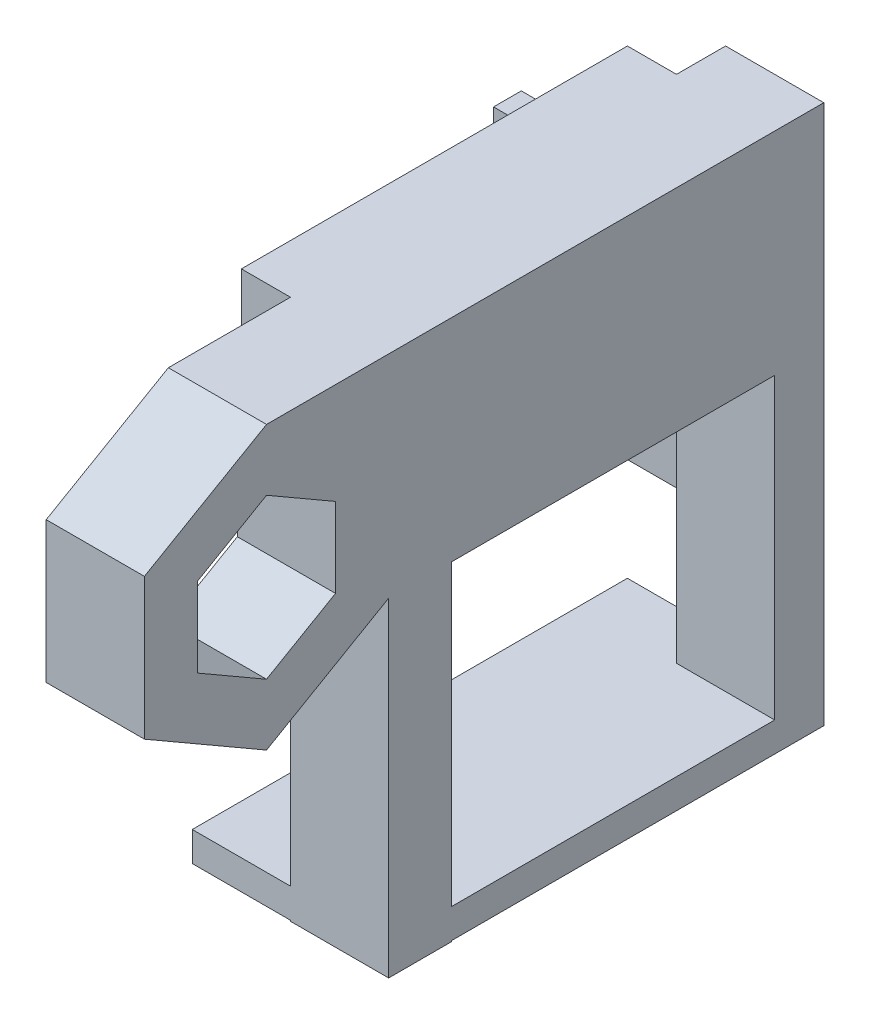
ISO-10303-21;
HEADER;
FILE_DESCRIPTION(('STEP AP214'),'2;1');
FILE_NAME('part.step','',(''),(''),'','','');
FILE_SCHEMA(('AUTOMOTIVE_DESIGN { 1 0 10303 214 1 1 1 1 }'));
ENDSEC;
DATA;
#1=APPLICATION_CONTEXT('core data for automotive mechanical design processes');
#2=APPLICATION_PROTOCOL_DEFINITION('international standard','automotive_design',2000,#1);
#3=PRODUCT_CONTEXT('',#1,'mechanical');
#4=PRODUCT('Part','Part','',(#3));
#5=PRODUCT_RELATED_PRODUCT_CATEGORY('part','',(#4));
#6=PRODUCT_DEFINITION_FORMATION('','',#4);
#7=PRODUCT_DEFINITION_CONTEXT('part definition',#1,'design');
#8=PRODUCT_DEFINITION('design','',#6,#7);
#9=PRODUCT_DEFINITION_SHAPE('','',#8);
#10=(LENGTH_UNIT() NAMED_UNIT(*) SI_UNIT(.MILLI.,.METRE.));
#11=(NAMED_UNIT(*) PLANE_ANGLE_UNIT() SI_UNIT($,.RADIAN.));
#12=(NAMED_UNIT(*) SI_UNIT($,.STERADIAN.) SOLID_ANGLE_UNIT());
#13=UNCERTAINTY_MEASURE_WITH_UNIT(LENGTH_MEASURE(1.E-05),#10,'distance_accuracy_value','');
#14=(GEOMETRIC_REPRESENTATION_CONTEXT(3) GLOBAL_UNCERTAINTY_ASSIGNED_CONTEXT((#13)) GLOBAL_UNIT_ASSIGNED_CONTEXT((#10,
#11,#12)) REPRESENTATION_CONTEXT('',''));
#15=CARTESIAN_POINT('',(0.,0.,0.));
#16=DIRECTION('',(0.,0.,1.));
#17=DIRECTION('',(1.,0.,0.));
#18=AXIS2_PLACEMENT_3D('',#15,#16,#17);
#19=CARTESIAN_POINT('',(0.,0.,0.));
#20=DIRECTION('',(1.,0.,0.));
#21=DIRECTION('',(0.,0.,-1.));
#22=AXIS2_PLACEMENT_3D('',#19,#20,#21);
#23=PLANE('',#22);
#24=DIRECTION('',(0.,-0.5,0.866025403784439));
#25=VECTOR('',#24,1.);
#26=CARTESIAN_POINT('',(0.,6.18116971697106,3.5687));
#27=LINE('',#26,#25);
#28=CARTESIAN_POINT('',(0.,8.24155962262808,0.));
#29=VERTEX_POINT('',#28);
#30=CARTESIAN_POINT('',(0.,4.12077981131404,7.13740000000001));
#31=VERTEX_POINT('',#30);
#32=EDGE_CURVE('E444',#29,#31,#27,.T.);
#33=ORIENTED_EDGE('',*,*,#32,.T.);
#34=DIRECTION('',(0.,-1.,0.));
#35=VECTOR('',#34,1.);
#36=CARTESIAN_POINT('',(0.,0.,7.13740000000001));
#37=LINE('',#36,#35);
#38=CARTESIAN_POINT('',(0.,-4.12077981131404,7.13740000000001));
#39=VERTEX_POINT('',#38);
#40=EDGE_CURVE('E459',#31,#39,#37,.T.);
#41=ORIENTED_EDGE('',*,*,#40,.T.);
#42=DIRECTION('',(0.,-0.5,-0.866025403784439));
#43=VECTOR('',#42,1.);
#44=CARTESIAN_POINT('',(0.,-6.18116971697106,3.56870000000001));
#45=LINE('',#44,#43);
#46=CARTESIAN_POINT('',(0.,-8.24155962262808,0.));
#47=VERTEX_POINT('',#46);
#48=EDGE_CURVE('E456',#39,#47,#45,.T.);
#49=ORIENTED_EDGE('',*,*,#48,.T.);
#50=DIRECTION('',(0.,0.5,-0.866025403784439));
#51=VECTOR('',#50,1.);
#52=CARTESIAN_POINT('',(0.,-6.18116971697105,-3.5687));
#53=LINE('',#52,#51);
#54=CARTESIAN_POINT('',(0.,-4.12077981131404,-7.1374));
#55=VERTEX_POINT('',#54);
#56=EDGE_CURVE('E453',#47,#55,#53,.T.);
#57=ORIENTED_EDGE('',*,*,#56,.T.);
#58=DIRECTION('',(0.,1.,0.));
#59=VECTOR('',#58,1.);
#60=CARTESIAN_POINT('',(0.,0.,-7.1374));
#61=LINE('',#60,#59);
#62=CARTESIAN_POINT('',(0.,4.12077981131404,-7.1374));
#63=VERTEX_POINT('',#62);
#64=EDGE_CURVE('E450',#55,#63,#61,.T.);
#65=ORIENTED_EDGE('',*,*,#64,.T.);
#66=DIRECTION('',(0.,0.5,0.866025403784439));
#67=VECTOR('',#66,1.);
#68=CARTESIAN_POINT('',(0.,6.18116971697106,-3.56870000000001));
#69=LINE('',#68,#67);
#70=EDGE_CURVE('E447',#63,#29,#69,.T.);
#71=ORIENTED_EDGE('',*,*,#70,.T.);
#72=EDGE_LOOP('',(#33,#41,#49,#57,#65,#71));
#73=FACE_BOUND('',#72,.T.);
#74=DIRECTION('',(0.,0.,1.));
#75=VECTOR('',#74,1.);
#76=CARTESIAN_POINT('',(0.,-24.6806074169967,-57.658));
#77=LINE('',#76,#75);
#78=CARTESIAN_POINT('',(0.,-24.6806074169967,-57.658));
#79=VERTEX_POINT('',#78);
#80=CARTESIAN_POINT('',(0.,-24.6806074169967,-54.7879844032337));
#81=VERTEX_POINT('',#80);
#82=EDGE_CURVE('E504',#79,#81,#77,.T.);
#83=ORIENTED_EDGE('',*,*,#82,.F.);
#84=DIRECTION('',(0.,1.,0.));
#85=VECTOR('',#84,1.);
#86=CARTESIAN_POINT('',(0.,14.5915596226281,-57.658));
#87=LINE('',#86,#85);
#88=CARTESIAN_POINT('',(0.,-38.182253963214,-57.658));
#89=VERTEX_POINT('',#88);
#90=EDGE_CURVE('E263',#89,#79,#87,.T.);
#91=ORIENTED_EDGE('',*,*,#90,.F.);
#92=DIRECTION('',(0.,0.,-1.));
#93=VECTOR('',#92,1.);
#94=CARTESIAN_POINT('',(0.,-38.182253963214,-57.658));
#95=LINE('',#94,#93);
#96=CARTESIAN_POINT('',(0.,-38.182253963214,-52.578));
#97=VERTEX_POINT('',#96);
#98=EDGE_CURVE('E289',#97,#89,#95,.T.);
#99=ORIENTED_EDGE('',*,*,#98,.F.);
#100=DIRECTION('',(0.,1.,0.));
#101=VECTOR('',#100,1.);
#102=CARTESIAN_POINT('',(0.,14.5915596226281,-52.578));
#103=LINE('',#102,#101);
#104=CARTESIAN_POINT('',(0.,-7.29577981131392,-52.578));
#105=VERTEX_POINT('',#104);
#106=EDGE_CURVE('E39',#97,#105,#103,.T.);
#107=ORIENTED_EDGE('',*,*,#106,.T.);
#108=DIRECTION('',(0.,0.,-1.));
#109=VECTOR('',#108,1.);
#110=CARTESIAN_POINT('',(0.,-7.29577981131392,-12.6366613140313));
#111=LINE('',#110,#109);
#112=CARTESIAN_POINT('',(0.,-7.29577981131392,-19.1149009460503));
#113=VERTEX_POINT('',#112);
#114=EDGE_CURVE('E392',#113,#105,#111,.T.);
#115=ORIENTED_EDGE('',*,*,#114,.F.);
#116=DIRECTION('',(0.,1.,0.));
#117=VECTOR('',#116,1.);
#118=CARTESIAN_POINT('',(0.,-41.3317798113139,-19.1149009460503));
#119=LINE('',#118,#117);
#120=CARTESIAN_POINT('',(0.,-38.182253963214,-19.1149009460503));
#121=VERTEX_POINT('',#120);
#122=EDGE_CURVE('E321',#121,#113,#119,.T.);
#123=ORIENTED_EDGE('',*,*,#122,.F.);
#124=CARTESIAN_POINT('',(0.,-38.182253963214,-12.6366613140313));
#125=VERTEX_POINT('',#124);
#126=EDGE_CURVE('E282',#125,#121,#95,.T.);
#127=ORIENTED_EDGE('',*,*,#126,.F.);
#128=DIRECTION('',(0.,1.,0.));
#129=VECTOR('',#128,1.);
#130=CARTESIAN_POINT('',(0.,-41.3317798113139,-12.6366613140313));
#131=LINE('',#130,#129);
#132=CARTESIAN_POINT('',(0.,-7.29577981131392,-12.6366613140313));
#133=VERTEX_POINT('',#132);
#134=EDGE_CURVE('E308',#125,#133,#131,.T.);
#135=ORIENTED_EDGE('',*,*,#134,.T.);
#136=DIRECTION('',(0.,0.500000000000007,-0.866025403784435));
#137=VECTOR('',#136,1.);
#138=CARTESIAN_POINT('',(0.,-10.943669716971,-6.31833065701568));
#139=LINE('',#138,#137);
#140=CARTESIAN_POINT('',(0.,-14.5915596226281,-1.01481323344643E-13));
#141=VERTEX_POINT('',#140);
#142=EDGE_CURVE('E441',#141,#133,#139,.T.);
#143=ORIENTED_EDGE('',*,*,#142,.F.);
#144=DIRECTION('',(0.,-0.499999999999995,-0.866025403784442));
#145=VECTOR('',#144,1.);
#146=CARTESIAN_POINT('',(0.,-10.9436697169711,6.31833065701553));
#147=LINE('',#146,#145);
#148=CARTESIAN_POINT('',(0.,-7.2957798113141,12.6366613140312));
#149=VERTEX_POINT('',#148);
#150=EDGE_CURVE('E434',#149,#141,#147,.T.);
#151=ORIENTED_EDGE('',*,*,#150,.F.);
#152=DIRECTION('',(0.,-1.,0.));
#153=VECTOR('',#152,1.);
#154=CARTESIAN_POINT('',(0.,0.,12.6366613140312));
#155=LINE('',#154,#153);
#156=CARTESIAN_POINT('',(0.,7.29577981131401,12.6366613140312));
#157=VERTEX_POINT('',#156);
#158=EDGE_CURVE('E429',#157,#149,#155,.T.);
#159=ORIENTED_EDGE('',*,*,#158,.F.);
#160=DIRECTION('',(0.,-0.500000000000001,0.866025403784438));
#161=VECTOR('',#160,1.);
#162=CARTESIAN_POINT('',(0.,10.943669716971,6.3183306570156));
#163=LINE('',#162,#161);
#164=CARTESIAN_POINT('',(0.,14.5915596226281,0.));
#165=VERTEX_POINT('',#164);
#166=EDGE_CURVE('E387',#165,#157,#163,.T.);
#167=ORIENTED_EDGE('',*,*,#166,.F.);
#168=DIRECTION('',(0.,0.,1.));
#169=VECTOR('',#168,1.);
#170=CARTESIAN_POINT('',(0.,14.5915596226281,0.));
#171=LINE('',#170,#169);
#172=CARTESIAN_POINT('',(0.,14.5915596226281,-12.6366613140313));
#173=VERTEX_POINT('',#172);
#174=EDGE_CURVE('E394',#173,#165,#171,.T.);
#175=ORIENTED_EDGE('',*,*,#174,.F.);
#176=DIRECTION('',(0.,1.,0.));
#177=VECTOR('',#176,1.);
#178=CARTESIAN_POINT('',(0.,14.5915596226281,-12.6366613140313));
#179=LINE('',#178,#177);
#180=CARTESIAN_POINT('',(0.,4.12077981131404,-12.6366613140313));
#181=VERTEX_POINT('',#180);
#182=EDGE_CURVE('E347',#181,#173,#179,.T.);
#183=ORIENTED_EDGE('',*,*,#182,.F.);
#184=DIRECTION('',(0.,0.,1.));
#185=VECTOR('',#184,1.);
#186=CARTESIAN_POINT('',(0.,4.12077981131404,-52.578));
#187=LINE('',#186,#185);
#188=CARTESIAN_POINT('',(0.,4.12077981131404,-52.578));
#189=VERTEX_POINT('',#188);
#190=EDGE_CURVE('E363',#189,#181,#187,.T.);
#191=ORIENTED_EDGE('',*,*,#190,.F.);
#192=CARTESIAN_POINT('',(0.,14.5915596226281,-52.578));
#193=VERTEX_POINT('',#192);
#194=EDGE_CURVE('E11',#189,#193,#103,.T.);
#195=ORIENTED_EDGE('',*,*,#194,.T.);
#196=DIRECTION('',(0.,0.,1.));
#197=VECTOR('',#196,1.);
#198=CARTESIAN_POINT('',(0.,14.5915596226281,-57.658));
#199=LINE('',#198,#197);
#200=CARTESIAN_POINT('',(0.,14.5915596226281,-57.658));
#201=VERTEX_POINT('',#200);
#202=EDGE_CURVE('E335',#201,#193,#199,.T.);
#203=ORIENTED_EDGE('',*,*,#202,.F.);
#204=CARTESIAN_POINT('',(0.,0.,-57.658));
#205=VERTEX_POINT('',#204);
#206=EDGE_CURVE('E330',#205,#201,#87,.T.);
#207=ORIENTED_EDGE('',*,*,#206,.F.);
#208=DIRECTION('',(0.,0.,-1.));
#209=VECTOR('',#208,1.);
#210=CARTESIAN_POINT('',(0.,0.,-57.658));
#211=LINE('',#210,#209);
#212=CARTESIAN_POINT('',(0.,0.,-54.7879844032337));
#213=VERTEX_POINT('',#212);
#214=EDGE_CURVE('E258',#213,#205,#211,.T.);
#215=ORIENTED_EDGE('',*,*,#214,.F.);
#216=DIRECTION('',(0.,1.,0.));
#217=VECTOR('',#216,1.);
#218=CARTESIAN_POINT('',(0.,-24.6806074169967,-54.7879844032337));
#219=LINE('',#218,#217);
#220=EDGE_CURVE('E500',#81,#213,#219,.T.);
#221=ORIENTED_EDGE('',*,*,#220,.F.);
#222=EDGE_LOOP('',(#83,#91,#99,#107,#115,#123,#127,#135,#143,#151,#159,#167,#175,#183,#191,#195,
#203,#207,#215,#221));
#223=FACE_BOUND('',#222,.T.);
#224=ADVANCED_FACE('F35',(#73,#223),#23,.F.);
#225=CARTESIAN_POINT('',(0.,0.,-52.578));
#226=DIRECTION('',(0.,0.,-1.));
#227=DIRECTION('',(-1.,0.,0.));
#228=AXIS2_PLACEMENT_3D('',#225,#226,#227);
#229=PLANE('',#228);
#230=DIRECTION('',(-1.,0.,0.));
#231=VECTOR('',#230,1.);
#232=CARTESIAN_POINT('',(10.16,-38.182253963214,-52.578));
#233=LINE('',#232,#231);
#234=CARTESIAN_POINT('',(10.16,-38.182253963214,-52.578));
#235=VERTEX_POINT('',#234);
#236=EDGE_CURVE('E264',#235,#97,#233,.T.);
#237=ORIENTED_EDGE('',*,*,#236,.F.);
#238=DIRECTION('',(0.,-1.,0.));
#239=VECTOR('',#238,1.);
#240=CARTESIAN_POINT('',(10.16,14.5915596226281,-52.578));
#241=LINE('',#240,#239);
#242=CARTESIAN_POINT('',(10.16,-7.29577981131392,-52.578));
#243=VERTEX_POINT('',#242);
#244=EDGE_CURVE('E325',#243,#235,#241,.T.);
#245=ORIENTED_EDGE('',*,*,#244,.F.);
#246=DIRECTION('',(-1.,0.,0.));
#247=VECTOR('',#246,1.);
#248=CARTESIAN_POINT('',(10.16,-7.29577981131392,-52.578));
#249=LINE('',#248,#247);
#250=EDGE_CURVE('E372',#243,#105,#249,.T.);
#251=ORIENTED_EDGE('',*,*,#250,.T.);
#252=ORIENTED_EDGE('',*,*,#106,.F.);
#253=EDGE_LOOP('',(#237,#245,#251,#252));
#254=FACE_BOUND('',#253,.T.);
#255=ADVANCED_FACE('F520',(#254),#229,.F.);
#256=CARTESIAN_POINT('',(0.,-41.3317798113139,-19.1149009460503));
#257=DIRECTION('',(0.,0.,1.));
#258=DIRECTION('',(1.,0.,0.));
#259=AXIS2_PLACEMENT_3D('',#256,#257,#258);
#260=PLANE('',#259);
#261=DIRECTION('',(1.,0.,0.));
#262=VECTOR('',#261,1.);
#263=CARTESIAN_POINT('',(0.,-38.182253963214,-19.1149009460503));
#264=LINE('',#263,#262);
#265=CARTESIAN_POINT('',(10.16,-38.182253963214,-19.1149009460503));
#266=VERTEX_POINT('',#265);
#267=EDGE_CURVE('E275',#121,#266,#264,.T.);
#268=ORIENTED_EDGE('',*,*,#267,.F.);
#269=ORIENTED_EDGE('',*,*,#122,.T.);
#270=DIRECTION('',(1.,0.,0.));
#271=VECTOR('',#270,1.);
#272=CARTESIAN_POINT('',(0.,-7.29577981131392,-19.1149009460503));
#273=LINE('',#272,#271);
#274=CARTESIAN_POINT('',(10.16,-7.29577981131392,-19.1149009460503));
#275=VERTEX_POINT('',#274);
#276=EDGE_CURVE('E298',#113,#275,#273,.T.);
#277=ORIENTED_EDGE('',*,*,#276,.T.);
#278=DIRECTION('',(0.,1.,0.));
#279=VECTOR('',#278,1.);
#280=CARTESIAN_POINT('',(10.16,-41.3317798113139,-19.1149009460503));
#281=LINE('',#280,#279);
#282=EDGE_CURVE('E317',#266,#275,#281,.T.);
#283=ORIENTED_EDGE('',*,*,#282,.F.);
#284=EDGE_LOOP('',(#268,#269,#277,#283));
#285=FACE_BOUND('',#284,.T.);
#286=ADVANCED_FACE('F529',(#285),#260,.F.);
#287=DIRECTION('',(-1.,0.,0.));
#288=VECTOR('',#287,1.);
#289=CARTESIAN_POINT('',(0.,-41.2382236655588,-19.1149009460503));
#290=LINE('',#289,#288);
#291=CARTESIAN_POINT('',(10.16,-41.2382236655588,-19.1149009460503));
#292=VERTEX_POINT('',#291);
#293=CARTESIAN_POINT('',(0.,-41.2382236655588,-19.1149009460503));
#294=VERTEX_POINT('',#293);
#295=EDGE_CURVE('E273',#292,#294,#290,.T.);
#296=ORIENTED_EDGE('',*,*,#295,.F.);
#297=CARTESIAN_POINT('',(10.16,-41.3317798113139,-19.1149009460503));
#298=VERTEX_POINT('',#297);
#299=EDGE_CURVE('E318',#298,#292,#281,.T.);
#300=ORIENTED_EDGE('',*,*,#299,.F.);
#301=DIRECTION('',(1.,0.,0.));
#302=VECTOR('',#301,1.);
#303=CARTESIAN_POINT('',(0.,-41.3317798113139,-19.1149009460503));
#304=LINE('',#303,#302);
#305=CARTESIAN_POINT('',(0.,-41.3317798113139,-19.1149009460503));
#306=VERTEX_POINT('',#305);
#307=EDGE_CURVE('E302',#306,#298,#304,.T.);
#308=ORIENTED_EDGE('',*,*,#307,.F.);
#309=EDGE_CURVE('E322',#306,#294,#119,.T.);
#310=ORIENTED_EDGE('',*,*,#309,.T.);
#311=EDGE_LOOP('',(#296,#300,#308,#310));
#312=FACE_BOUND('',#311,.T.);
#313=ADVANCED_FACE('F554',(#312),#260,.F.);
#314=DIRECTION('',(0.,0.,1.));
#315=VECTOR('',#314,1.);
#316=CARTESIAN_POINT('',(0.,-41.2382236655588,-57.658));
#317=LINE('',#316,#315);
#318=CARTESIAN_POINT('',(0.,-41.2382236655588,-12.6366613140313));
#319=VERTEX_POINT('',#318);
#320=EDGE_CURVE('E277',#294,#319,#317,.T.);
#321=ORIENTED_EDGE('',*,*,#320,.F.);
#322=ORIENTED_EDGE('',*,*,#309,.F.);
#323=DIRECTION('',(0.,0.,-1.));
#324=VECTOR('',#323,1.);
#325=CARTESIAN_POINT('',(0.,-41.3317798113139,-12.6366613140313));
#326=LINE('',#325,#324);
#327=CARTESIAN_POINT('',(0.,-41.3317798113139,-12.6366613140313));
#328=VERTEX_POINT('',#327);
#329=EDGE_CURVE('E299',#328,#306,#326,.T.);
#330=ORIENTED_EDGE('',*,*,#329,.F.);
#331=EDGE_CURVE('E311',#328,#319,#131,.T.);
#332=ORIENTED_EDGE('',*,*,#331,.T.);
#333=EDGE_LOOP('',(#321,#322,#330,#332));
#334=FACE_BOUND('',#333,.T.);
#335=ADVANCED_FACE('F548',(#334),#23,.F.);
#336=CARTESIAN_POINT('',(10.16,-7.29577981131392,-12.6366613140313));
#337=DIRECTION('',(0.,1.,0.));
#338=DIRECTION('',(0.,0.,1.));
#339=AXIS2_PLACEMENT_3D('',#336,#337,#338);
#340=PLANE('',#339);
#341=ORIENTED_EDGE('',*,*,#276,.F.);
#342=ORIENTED_EDGE('',*,*,#114,.T.);
#343=ORIENTED_EDGE('',*,*,#250,.F.);
#344=DIRECTION('',(0.,0.,-1.));
#345=VECTOR('',#344,1.);
#346=CARTESIAN_POINT('',(10.16,-7.29577981131392,-12.6366613140313));
#347=LINE('',#346,#345);
#348=EDGE_CURVE('E393',#275,#243,#347,.T.);
#349=ORIENTED_EDGE('',*,*,#348,.F.);
#350=EDGE_LOOP('',(#341,#342,#343,#349));
#351=FACE_BOUND('',#350,.T.);
#352=ADVANCED_FACE('F524',(#351),#340,.F.);
#353=CARTESIAN_POINT('',(10.16,-7.29577981131392,-52.578));
#354=DIRECTION('',(0.,0.,1.));
#355=DIRECTION('',(1.,0.,0.));
#356=AXIS2_PLACEMENT_3D('',#353,#354,#355);
#357=PLANE('',#356);
#358=ORIENTED_EDGE('',*,*,#194,.F.);
#359=DIRECTION('',(1.,0.,0.));
#360=VECTOR('',#359,1.);
#361=CARTESIAN_POINT('',(-5.08,4.12077981131404,-52.578));
#362=LINE('',#361,#360);
#363=CARTESIAN_POINT('',(-5.08,4.12077981131404,-52.578));
#364=VERTEX_POINT('',#363);
#365=EDGE_CURVE('E404',#364,#189,#362,.T.);
#366=ORIENTED_EDGE('',*,*,#365,.F.);
#367=DIRECTION('',(0.,-1.,0.));
#368=VECTOR('',#367,1.);
#369=CARTESIAN_POINT('',(-5.08,14.5915596226281,-52.578));
#370=LINE('',#369,#368);
#371=CARTESIAN_POINT('',(-5.08,14.5915596226281,-52.578));
#372=VERTEX_POINT('',#371);
#373=EDGE_CURVE('E343',#372,#364,#370,.T.);
#374=ORIENTED_EDGE('',*,*,#373,.F.);
#375=DIRECTION('',(-1.,0.,0.));
#376=VECTOR('',#375,1.);
#377=CARTESIAN_POINT('',(10.16,14.5915596226281,-52.578));
#378=LINE('',#377,#376);
#379=EDGE_CURVE('E370',#193,#372,#378,.T.);
#380=ORIENTED_EDGE('',*,*,#379,.F.);
#381=EDGE_LOOP('',(#358,#366,#374,#380));
#382=FACE_BOUND('',#381,.T.);
#383=ADVANCED_FACE('F560',(#382),#357,.F.);
#384=CARTESIAN_POINT('',(10.16,6.18116971697106,3.5687));
#385=DIRECTION('',(0.,-0.866025403784439,-0.5));
#386=DIRECTION('',(0.,0.5,-0.866025403784439));
#387=AXIS2_PLACEMENT_3D('',#384,#385,#386);
#388=PLANE('',#387);
#389=ORIENTED_EDGE('',*,*,#32,.F.);
#390=DIRECTION('',(-1.,0.,0.));
#391=VECTOR('',#390,1.);
#392=CARTESIAN_POINT('',(10.16,8.24155962262808,0.));
#393=LINE('',#392,#391);
#394=CARTESIAN_POINT('',(10.16,8.24155962262808,0.));
#395=VERTEX_POINT('',#394);
#396=EDGE_CURVE('E45',#395,#29,#393,.T.);
#397=ORIENTED_EDGE('',*,*,#396,.F.);
#398=DIRECTION('',(0.,-0.5,0.866025403784439));
#399=VECTOR('',#398,1.);
#400=CARTESIAN_POINT('',(10.16,6.18116971697106,3.5687));
#401=LINE('',#400,#399);
#402=CARTESIAN_POINT('',(10.16,4.12077981131404,7.13740000000001));
#403=VERTEX_POINT('',#402);
#404=EDGE_CURVE('E597',#395,#403,#401,.T.);
#405=ORIENTED_EDGE('',*,*,#404,.T.);
#406=DIRECTION('',(-1.,0.,0.));
#407=VECTOR('',#406,1.);
#408=CARTESIAN_POINT('',(10.16,4.12077981131404,7.13740000000001));
#409=LINE('',#408,#407);
#410=EDGE_CURVE('E462',#403,#31,#409,.T.);
#411=ORIENTED_EDGE('',*,*,#410,.T.);
#412=EDGE_LOOP('',(#389,#397,#405,#411));
#413=FACE_BOUND('',#412,.T.);
#414=ADVANCED_FACE('F628',(#413),#388,.T.);
#415=CARTESIAN_POINT('',(10.16,6.18116971697106,-3.56870000000001));
#416=DIRECTION('',(0.,-0.866025403784438,0.5));
#417=DIRECTION('',(0.,-0.5,-0.866025403784439));
#418=AXIS2_PLACEMENT_3D('',#415,#416,#417);
#419=PLANE('',#418);
#420=ORIENTED_EDGE('',*,*,#70,.F.);
#421=DIRECTION('',(-1.,0.,0.));
#422=VECTOR('',#421,1.);
#423=CARTESIAN_POINT('',(10.16,4.12077981131404,-7.1374));
#424=LINE('',#423,#422);
#425=CARTESIAN_POINT('',(10.16,4.12077981131404,-7.1374));
#426=VERTEX_POINT('',#425);
#427=EDGE_CURVE('E470',#426,#63,#424,.T.);
#428=ORIENTED_EDGE('',*,*,#427,.F.);
#429=DIRECTION('',(0.,0.5,0.866025403784439));
#430=VECTOR('',#429,1.);
#431=CARTESIAN_POINT('',(10.16,6.18116971697106,-3.56870000000001));
#432=LINE('',#431,#430);
#433=EDGE_CURVE('E600',#426,#395,#432,.T.);
#434=ORIENTED_EDGE('',*,*,#433,.T.);
#435=ORIENTED_EDGE('',*,*,#396,.T.);
#436=EDGE_LOOP('',(#420,#428,#434,#435));
#437=FACE_BOUND('',#436,.T.);
#438=ADVANCED_FACE('F630',(#437),#419,.T.);
#439=CARTESIAN_POINT('',(10.16,0.,-7.1374));
#440=DIRECTION('',(0.,0.,1.));
#441=DIRECTION('',(1.,0.,0.));
#442=AXIS2_PLACEMENT_3D('',#439,#440,#441);
#443=PLANE('',#442);
#444=ORIENTED_EDGE('',*,*,#64,.F.);
#445=DIRECTION('',(-1.,0.,0.));
#446=VECTOR('',#445,1.);
#447=CARTESIAN_POINT('',(10.16,-4.12077981131404,-7.1374));
#448=LINE('',#447,#446);
#449=CARTESIAN_POINT('',(10.16,-4.12077981131404,-7.1374));
#450=VERTEX_POINT('',#449);
#451=EDGE_CURVE('E468',#450,#55,#448,.T.);
#452=ORIENTED_EDGE('',*,*,#451,.F.);
#453=DIRECTION('',(0.,1.,0.));
#454=VECTOR('',#453,1.);
#455=CARTESIAN_POINT('',(10.16,0.,-7.1374));
#456=LINE('',#455,#454);
#457=EDGE_CURVE('E603',#450,#426,#456,.T.);
#458=ORIENTED_EDGE('',*,*,#457,.T.);
#459=ORIENTED_EDGE('',*,*,#427,.T.);
#460=EDGE_LOOP('',(#444,#452,#458,#459));
#461=FACE_BOUND('',#460,.T.);
#462=ADVANCED_FACE('F632',(#461),#443,.T.);
#463=CARTESIAN_POINT('',(10.16,-6.18116971697105,-3.5687));
#464=DIRECTION('',(0.,0.866025403784439,0.5));
#465=DIRECTION('',(0.,-0.5,0.866025403784439));
#466=AXIS2_PLACEMENT_3D('',#463,#464,#465);
#467=PLANE('',#466);
#468=ORIENTED_EDGE('',*,*,#56,.F.);
#469=DIRECTION('',(-1.,0.,0.));
#470=VECTOR('',#469,1.);
#471=CARTESIAN_POINT('',(10.16,-8.24155962262808,0.));
#472=LINE('',#471,#470);
#473=CARTESIAN_POINT('',(10.16,-8.24155962262808,0.));
#474=VERTEX_POINT('',#473);
#475=EDGE_CURVE('E466',#474,#47,#472,.T.);
#476=ORIENTED_EDGE('',*,*,#475,.F.);
#477=DIRECTION('',(0.,0.5,-0.866025403784439));
#478=VECTOR('',#477,1.);
#479=CARTESIAN_POINT('',(10.16,-6.18116971697105,-3.5687));
#480=LINE('',#479,#478);
#481=EDGE_CURVE('E606',#474,#450,#480,.T.);
#482=ORIENTED_EDGE('',*,*,#481,.T.);
#483=ORIENTED_EDGE('',*,*,#451,.T.);
#484=EDGE_LOOP('',(#468,#476,#482,#483));
#485=FACE_BOUND('',#484,.T.);
#486=ADVANCED_FACE('F622',(#485),#467,.T.);
#487=CARTESIAN_POINT('',(10.16,-6.18116971697106,3.56870000000001));
#488=DIRECTION('',(0.,0.866025403784438,-0.5));
#489=DIRECTION('',(0.,0.5,0.866025403784439));
#490=AXIS2_PLACEMENT_3D('',#487,#488,#489);
#491=PLANE('',#490);
#492=ORIENTED_EDGE('',*,*,#48,.F.);
#493=DIRECTION('',(-1.,0.,0.));
#494=VECTOR('',#493,1.);
#495=CARTESIAN_POINT('',(10.16,-4.12077981131404,7.13740000000001));
#496=LINE('',#495,#494);
#497=CARTESIAN_POINT('',(10.16,-4.12077981131404,7.13740000000001));
#498=VERTEX_POINT('',#497);
#499=EDGE_CURVE('E464',#498,#39,#496,.T.);
#500=ORIENTED_EDGE('',*,*,#499,.F.);
#501=DIRECTION('',(0.,-0.5,-0.866025403784439));
#502=VECTOR('',#501,1.);
#503=CARTESIAN_POINT('',(10.16,-6.18116971697106,3.56870000000001));
#504=LINE('',#503,#502);
#505=EDGE_CURVE('E608',#498,#474,#504,.T.);
#506=ORIENTED_EDGE('',*,*,#505,.T.);
#507=ORIENTED_EDGE('',*,*,#475,.T.);
#508=EDGE_LOOP('',(#492,#500,#506,#507));
#509=FACE_BOUND('',#508,.T.);
#510=ADVANCED_FACE('F624',(#509),#491,.T.);
#511=CARTESIAN_POINT('',(10.16,10.943669716971,6.3183306570156));
#512=DIRECTION('',(0.,-0.866025403784438,-0.500000000000001));
#513=DIRECTION('',(0.,0.500000000000001,-0.866025403784438));
#514=AXIS2_PLACEMENT_3D('',#511,#512,#513);
#515=PLANE('',#514);
#516=ORIENTED_EDGE('',*,*,#166,.T.);
#517=DIRECTION('',(-1.,0.,0.));
#518=VECTOR('',#517,1.);
#519=CARTESIAN_POINT('',(10.16,7.29577981131401,12.6366613140312));
#520=LINE('',#519,#518);
#521=CARTESIAN_POINT('',(10.16,7.29577981131401,12.6366613140312));
#522=VERTEX_POINT('',#521);
#523=EDGE_CURVE('E481',#522,#157,#520,.T.);
#524=ORIENTED_EDGE('',*,*,#523,.F.);
#525=DIRECTION('',(0.,-0.500000000000001,0.866025403784438));
#526=VECTOR('',#525,1.);
#527=CARTESIAN_POINT('',(10.16,10.943669716971,6.3183306570156));
#528=LINE('',#527,#526);
#529=CARTESIAN_POINT('',(10.16,14.5915596226281,0.));
#530=VERTEX_POINT('',#529);
#531=EDGE_CURVE('E381',#530,#522,#528,.T.);
#532=ORIENTED_EDGE('',*,*,#531,.F.);
#533=DIRECTION('',(-1.,0.,0.));
#534=VECTOR('',#533,1.);
#535=CARTESIAN_POINT('',(10.16,14.5915596226281,0.));
#536=LINE('',#535,#534);
#537=EDGE_CURVE('E407',#530,#165,#536,.T.);
#538=ORIENTED_EDGE('',*,*,#537,.T.);
#539=EDGE_LOOP('',(#516,#524,#532,#538));
#540=FACE_BOUND('',#539,.T.);
#541=ADVANCED_FACE('F37',(#540),#515,.F.);
#542=CARTESIAN_POINT('',(10.16,0.,12.6366613140312));
#543=DIRECTION('',(0.,0.,-1.));
#544=DIRECTION('',(0.,1.,0.));
#545=AXIS2_PLACEMENT_3D('',#542,#543,#544);
#546=PLANE('',#545);
#547=ORIENTED_EDGE('',*,*,#158,.T.);
#548=DIRECTION('',(-1.,0.,0.));
#549=VECTOR('',#548,1.);
#550=CARTESIAN_POINT('',(10.16,-7.2957798113141,12.6366613140312));
#551=LINE('',#550,#549);
#552=CARTESIAN_POINT('',(10.16,-7.2957798113141,12.6366613140312));
#553=VERTEX_POINT('',#552);
#554=EDGE_CURVE('E479',#553,#149,#551,.T.);
#555=ORIENTED_EDGE('',*,*,#554,.F.);
#556=DIRECTION('',(0.,-1.,0.));
#557=VECTOR('',#556,1.);
#558=CARTESIAN_POINT('',(10.16,0.,12.6366613140312));
#559=LINE('',#558,#557);
#560=EDGE_CURVE('E593',#522,#553,#559,.T.);
#561=ORIENTED_EDGE('',*,*,#560,.F.);
#562=ORIENTED_EDGE('',*,*,#523,.T.);
#563=EDGE_LOOP('',(#547,#555,#561,#562));
#564=FACE_BOUND('',#563,.T.);
#565=ADVANCED_FACE('F592',(#564),#546,.F.);
#566=CARTESIAN_POINT('',(10.16,-10.9436697169711,6.31833065701553));
#567=DIRECTION('',(0.,0.866025403784441,-0.499999999999995));
#568=DIRECTION('',(0.,0.499999999999995,0.866025403784442));
#569=AXIS2_PLACEMENT_3D('',#566,#567,#568);
#570=PLANE('',#569);
#571=ORIENTED_EDGE('',*,*,#150,.T.);
#572=DIRECTION('',(-1.,0.,0.));
#573=VECTOR('',#572,1.);
#574=CARTESIAN_POINT('',(10.16,-14.5915596226281,-1.01481323344643E-13));
#575=LINE('',#574,#573);
#576=CARTESIAN_POINT('',(10.16,-14.5915596226281,-1.01481323344643E-13));
#577=VERTEX_POINT('',#576);
#578=EDGE_CURVE('E476',#577,#141,#575,.T.);
#579=ORIENTED_EDGE('',*,*,#578,.F.);
#580=DIRECTION('',(0.,-0.499999999999995,-0.866025403784442));
#581=VECTOR('',#580,1.);
#582=CARTESIAN_POINT('',(10.16,-10.9436697169711,6.31833065701553));
#583=LINE('',#582,#581);
#584=EDGE_CURVE('E590',#553,#577,#583,.T.);
#585=ORIENTED_EDGE('',*,*,#584,.F.);
#586=ORIENTED_EDGE('',*,*,#554,.T.);
#587=EDGE_LOOP('',(#571,#579,#585,#586));
#588=FACE_BOUND('',#587,.T.);
#589=ADVANCED_FACE('F589',(#588),#570,.F.);
#590=CARTESIAN_POINT('',(10.16,-10.943669716971,-6.31833065701568));
#591=DIRECTION('',(0.,0.866025403784435,0.500000000000007));
#592=DIRECTION('',(0.,-0.500000000000007,0.866025403784435));
#593=AXIS2_PLACEMENT_3D('',#590,#591,#592);
#594=PLANE('',#593);
#595=ORIENTED_EDGE('',*,*,#142,.T.);
#596=DIRECTION('',(-1.,0.,0.));
#597=VECTOR('',#596,1.);
#598=CARTESIAN_POINT('',(10.16,-7.29577981131392,-12.6366613140313));
#599=LINE('',#598,#597);
#600=CARTESIAN_POINT('',(10.16,-7.29577981131392,-12.6366613140313));
#601=VERTEX_POINT('',#600);
#602=EDGE_CURVE('E473',#601,#133,#599,.T.);
#603=ORIENTED_EDGE('',*,*,#602,.F.);
#604=DIRECTION('',(0.,0.500000000000007,-0.866025403784435));
#605=VECTOR('',#604,1.);
#606=CARTESIAN_POINT('',(10.16,-10.943669716971,-6.31833065701568));
#607=LINE('',#606,#605);
#608=EDGE_CURVE('E586',#577,#601,#607,.T.);
#609=ORIENTED_EDGE('',*,*,#608,.F.);
#610=ORIENTED_EDGE('',*,*,#578,.T.);
#611=EDGE_LOOP('',(#595,#603,#609,#610));
#612=FACE_BOUND('',#611,.T.);
#613=ADVANCED_FACE('F541',(#612),#594,.F.);
#614=CARTESIAN_POINT('',(10.16,0.,7.13740000000001));
#615=DIRECTION('',(0.,0.,-1.));
#616=DIRECTION('',(0.,1.,0.));
#617=AXIS2_PLACEMENT_3D('',#614,#615,#616);
#618=PLANE('',#617);
#619=ORIENTED_EDGE('',*,*,#40,.F.);
#620=ORIENTED_EDGE('',*,*,#410,.F.);
#621=DIRECTION('',(0.,-1.,0.));
#622=VECTOR('',#621,1.);
#623=CARTESIAN_POINT('',(10.16,0.,7.13740000000001));
#624=LINE('',#623,#622);
#625=EDGE_CURVE('E437',#403,#498,#624,.T.);
#626=ORIENTED_EDGE('',*,*,#625,.T.);
#627=ORIENTED_EDGE('',*,*,#499,.T.);
#628=EDGE_LOOP('',(#619,#620,#626,#627));
#629=FACE_BOUND('',#628,.T.);
#630=ADVANCED_FACE('F534',(#629),#618,.T.);
#631=CARTESIAN_POINT('',(10.16,0.,0.));
#632=DIRECTION('',(1.,0.,0.));
#633=DIRECTION('',(0.,0.,-1.));
#634=AXIS2_PLACEMENT_3D('',#631,#632,#633);
#635=PLANE('',#634);
#636=DIRECTION('',(0.,0.,-1.));
#637=VECTOR('',#636,1.);
#638=CARTESIAN_POINT('',(10.16,-38.182253963214,-19.05));
#639=LINE('',#638,#637);
#640=EDGE_CURVE('E266',#266,#235,#639,.T.);
#641=ORIENTED_EDGE('',*,*,#640,.F.);
#642=ORIENTED_EDGE('',*,*,#282,.T.);
#643=ORIENTED_EDGE('',*,*,#348,.T.);
#644=ORIENTED_EDGE('',*,*,#244,.T.);
#645=EDGE_LOOP('',(#641,#642,#643,#644));
#646=FACE_BOUND('',#645,.T.);
#647=ORIENTED_EDGE('',*,*,#299,.T.);
#648=DIRECTION('',(0.,0.,1.));
#649=VECTOR('',#648,1.);
#650=CARTESIAN_POINT('',(10.16,-41.2382236655588,-57.658));
#651=LINE('',#650,#649);
#652=CARTESIAN_POINT('',(10.16,-41.2382236655588,-57.658));
#653=VERTEX_POINT('',#652);
#654=EDGE_CURVE('E342',#653,#292,#651,.T.);
#655=ORIENTED_EDGE('',*,*,#654,.F.);
#656=DIRECTION('',(0.,-1.,0.));
#657=VECTOR('',#656,1.);
#658=CARTESIAN_POINT('',(10.16,14.5915596226281,-57.658));
#659=LINE('',#658,#657);
#660=CARTESIAN_POINT('',(10.16,14.5915596226281,-57.658));
#661=VERTEX_POINT('',#660);
#662=EDGE_CURVE('E326',#661,#653,#659,.T.);
#663=ORIENTED_EDGE('',*,*,#662,.F.);
#664=DIRECTION('',(0.,0.,1.));
#665=VECTOR('',#664,1.);
#666=CARTESIAN_POINT('',(10.16,14.5915596226281,0.));
#667=LINE('',#666,#665);
#668=EDGE_CURVE('E373',#661,#530,#667,.T.);
#669=ORIENTED_EDGE('',*,*,#668,.T.);
#670=ORIENTED_EDGE('',*,*,#531,.T.);
#671=ORIENTED_EDGE('',*,*,#560,.T.);
#672=ORIENTED_EDGE('',*,*,#584,.T.);
#673=ORIENTED_EDGE('',*,*,#608,.T.);
#674=DIRECTION('',(0.,1.,0.));
#675=VECTOR('',#674,1.);
#676=CARTESIAN_POINT('',(10.16,-41.3317798113139,-12.6366613140313));
#677=LINE('',#676,#675);
#678=CARTESIAN_POINT('',(10.16,-41.3317798113139,-12.6366613140313));
#679=VERTEX_POINT('',#678);
#680=EDGE_CURVE('E314',#679,#601,#677,.T.);
#681=ORIENTED_EDGE('',*,*,#680,.F.);
#682=DIRECTION('',(0.,0.,1.));
#683=VECTOR('',#682,1.);
#684=CARTESIAN_POINT('',(10.16,-41.3317798113139,-12.6366613140313));
#685=LINE('',#684,#683);
#686=EDGE_CURVE('E304',#298,#679,#685,.T.);
#687=ORIENTED_EDGE('',*,*,#686,.F.);
#688=EDGE_LOOP('',(#647,#655,#663,#669,#670,#671,#672,#673,#681,#687));
#689=FACE_BOUND('',#688,.T.);
#690=ORIENTED_EDGE('',*,*,#404,.F.);
#691=ORIENTED_EDGE('',*,*,#433,.F.);
#692=ORIENTED_EDGE('',*,*,#457,.F.);
#693=ORIENTED_EDGE('',*,*,#481,.F.);
#694=ORIENTED_EDGE('',*,*,#505,.F.);
#695=ORIENTED_EDGE('',*,*,#625,.F.);
#696=EDGE_LOOP('',(#690,#691,#692,#693,#694,#695));
#697=FACE_BOUND('',#696,.T.);
#698=ADVANCED_FACE('F490',(#646,#689,#697),#635,.T.);
#699=CARTESIAN_POINT('',(10.16,14.5915596226281,0.));
#700=DIRECTION('',(0.,-1.,0.));
#701=DIRECTION('',(0.,0.,-1.));
#702=AXIS2_PLACEMENT_3D('',#699,#700,#701);
#703=PLANE('',#702);
#704=ORIENTED_EDGE('',*,*,#668,.F.);
#705=DIRECTION('',(1.,0.,0.));
#706=VECTOR('',#705,1.);
#707=CARTESIAN_POINT('',(10.16,14.5915596226281,-57.658));
#708=LINE('',#707,#706);
#709=EDGE_CURVE('E332',#201,#661,#708,.T.);
#710=ORIENTED_EDGE('',*,*,#709,.F.);
#711=ORIENTED_EDGE('',*,*,#202,.T.);
#712=ORIENTED_EDGE('',*,*,#379,.T.);
#713=DIRECTION('',(0.,0.,-1.));
#714=VECTOR('',#713,1.);
#715=CARTESIAN_POINT('',(-5.08,14.5915596226281,-52.578));
#716=LINE('',#715,#714);
#717=CARTESIAN_POINT('',(-5.08,14.5915596226281,-12.6366613140313));
#718=VERTEX_POINT('',#717);
#719=EDGE_CURVE('E351',#718,#372,#716,.T.);
#720=ORIENTED_EDGE('',*,*,#719,.F.);
#721=DIRECTION('',(1.,0.,0.));
#722=VECTOR('',#721,1.);
#723=CARTESIAN_POINT('',(-5.08,14.5915596226281,-12.6366613140313));
#724=LINE('',#723,#722);
#725=EDGE_CURVE('E354',#718,#173,#724,.T.);
#726=ORIENTED_EDGE('',*,*,#725,.T.);
#727=ORIENTED_EDGE('',*,*,#174,.T.);
#728=ORIENTED_EDGE('',*,*,#537,.F.);
#729=EDGE_LOOP('',(#704,#710,#711,#712,#720,#726,#727,#728));
#730=FACE_BOUND('',#729,.T.);
#731=ADVANCED_FACE('F484',(#730),#703,.F.);
#732=CARTESIAN_POINT('',(-5.08,4.12077981131404,-52.578));
#733=DIRECTION('',(0.,1.,0.));
#734=DIRECTION('',(0.,0.,1.));
#735=AXIS2_PLACEMENT_3D('',#732,#733,#734);
#736=PLANE('',#735);
#737=ORIENTED_EDGE('',*,*,#190,.T.);
#738=DIRECTION('',(1.,0.,0.));
#739=VECTOR('',#738,1.);
#740=CARTESIAN_POINT('',(-5.08,4.12077981131404,-12.6366613140313));
#741=LINE('',#740,#739);
#742=CARTESIAN_POINT('',(-5.08,4.12077981131404,-12.6366613140313));
#743=VERTEX_POINT('',#742);
#744=EDGE_CURVE('E357',#743,#181,#741,.T.);
#745=ORIENTED_EDGE('',*,*,#744,.F.);
#746=DIRECTION('',(0.,0.,1.));
#747=VECTOR('',#746,1.);
#748=CARTESIAN_POINT('',(-5.08,4.12077981131404,-52.578));
#749=LINE('',#748,#747);
#750=EDGE_CURVE('E346',#364,#743,#749,.T.);
#751=ORIENTED_EDGE('',*,*,#750,.F.);
#752=ORIENTED_EDGE('',*,*,#365,.T.);
#753=EDGE_LOOP('',(#737,#745,#751,#752));
#754=FACE_BOUND('',#753,.T.);
#755=ADVANCED_FACE('F421',(#754),#736,.F.);
#756=CARTESIAN_POINT('',(-5.08,14.5915596226281,-12.6366613140313));
#757=DIRECTION('',(0.,0.,-1.));
#758=DIRECTION('',(-1.,0.,0.));
#759=AXIS2_PLACEMENT_3D('',#756,#757,#758);
#760=PLANE('',#759);
#761=ORIENTED_EDGE('',*,*,#182,.T.);
#762=ORIENTED_EDGE('',*,*,#725,.F.);
#763=DIRECTION('',(0.,1.,0.));
#764=VECTOR('',#763,1.);
#765=CARTESIAN_POINT('',(-5.08,14.5915596226281,-12.6366613140313));
#766=LINE('',#765,#764);
#767=EDGE_CURVE('E349',#743,#718,#766,.T.);
#768=ORIENTED_EDGE('',*,*,#767,.F.);
#769=ORIENTED_EDGE('',*,*,#744,.T.);
#770=EDGE_LOOP('',(#761,#762,#768,#769));
#771=FACE_BOUND('',#770,.T.);
#772=ADVANCED_FACE('F419',(#771),#760,.F.);
#773=CARTESIAN_POINT('',(-5.08,0.,0.));
#774=DIRECTION('',(-1.,0.,0.));
#775=DIRECTION('',(0.,0.,1.));
#776=AXIS2_PLACEMENT_3D('',#773,#774,#775);
#777=PLANE('',#776);
#778=ORIENTED_EDGE('',*,*,#373,.T.);
#779=ORIENTED_EDGE('',*,*,#750,.T.);
#780=ORIENTED_EDGE('',*,*,#767,.T.);
#781=ORIENTED_EDGE('',*,*,#719,.T.);
#782=EDGE_LOOP('',(#778,#779,#780,#781));
#783=FACE_BOUND('',#782,.T.);
#784=ADVANCED_FACE('F775',(#783),#777,.T.);
#785=CARTESIAN_POINT('',(10.16,-41.2382236655588,-57.658));
#786=DIRECTION('',(0.,1.,0.));
#787=DIRECTION('',(0.,0.,1.));
#788=AXIS2_PLACEMENT_3D('',#785,#786,#787);
#789=PLANE('',#788);
#790=ORIENTED_EDGE('',*,*,#654,.T.);
#791=ORIENTED_EDGE('',*,*,#295,.T.);
#792=ORIENTED_EDGE('',*,*,#320,.T.);
#793=DIRECTION('',(1.,0.,0.));
#794=VECTOR('',#793,1.);
#795=CARTESIAN_POINT('',(-10.16,-41.2382236655588,-12.6366613140313));
#796=LINE('',#795,#794);
#797=CARTESIAN_POINT('',(-10.16,-41.2382236655588,-12.6366613140313));
#798=VERTEX_POINT('',#797);
#799=EDGE_CURVE('E295',#798,#319,#796,.T.);
#800=ORIENTED_EDGE('',*,*,#799,.F.);
#801=DIRECTION('',(0.,0.,1.));
#802=VECTOR('',#801,1.);
#803=CARTESIAN_POINT('',(-10.16,-41.2382236655588,-57.658));
#804=LINE('',#803,#802);
#805=CARTESIAN_POINT('',(-10.16,-41.2382236655588,-57.658));
#806=VERTEX_POINT('',#805);
#807=EDGE_CURVE('E281',#806,#798,#804,.T.);
#808=ORIENTED_EDGE('',*,*,#807,.F.);
#809=DIRECTION('',(-1.,0.,0.));
#810=VECTOR('',#809,1.);
#811=CARTESIAN_POINT('',(10.16,-41.2382236655588,-57.658));
#812=LINE('',#811,#810);
#813=EDGE_CURVE('E328',#653,#806,#812,.T.);
#814=ORIENTED_EDGE('',*,*,#813,.F.);
#815=EDGE_LOOP('',(#790,#791,#792,#800,#808,#814));
#816=FACE_BOUND('',#815,.T.);
#817=ADVANCED_FACE('F577',(#816),#789,.F.);
#818=CARTESIAN_POINT('',(0.,0.,-57.658));
#819=DIRECTION('',(0.,0.,-1.));
#820=DIRECTION('',(-1.,0.,0.));
#821=AXIS2_PLACEMENT_3D('',#818,#819,#820);
#822=PLANE('',#821);
#823=ORIENTED_EDGE('',*,*,#662,.T.);
#824=ORIENTED_EDGE('',*,*,#813,.T.);
#825=DIRECTION('',(0.,-1.,0.));
#826=VECTOR('',#825,1.);
#827=CARTESIAN_POINT('',(-10.16,-41.2382236655588,-57.658));
#828=LINE('',#827,#826);
#829=CARTESIAN_POINT('',(-10.16,-38.182253963214,-57.658));
#830=VERTEX_POINT('',#829);
#831=EDGE_CURVE('E278',#830,#806,#828,.T.);
#832=ORIENTED_EDGE('',*,*,#831,.F.);
#833=DIRECTION('',(1.,0.,0.));
#834=VECTOR('',#833,1.);
#835=CARTESIAN_POINT('',(-10.16,-38.182253963214,-57.658));
#836=LINE('',#835,#834);
#837=EDGE_CURVE('E60',#830,#89,#836,.T.);
#838=ORIENTED_EDGE('',*,*,#837,.T.);
#839=ORIENTED_EDGE('',*,*,#90,.T.);
#840=DIRECTION('',(1.,0.,0.));
#841=VECTOR('',#840,1.);
#842=CARTESIAN_POINT('',(-21.13915,-24.6806074169967,-57.658));
#843=LINE('',#842,#841);
#844=CARTESIAN_POINT('',(-21.13915,-24.6806074169967,-57.658));
#845=VERTEX_POINT('',#844);
#846=EDGE_CURVE('E246',#845,#79,#843,.T.);
#847=ORIENTED_EDGE('',*,*,#846,.F.);
#848=DIRECTION('',(0.,-1.,0.));
#849=VECTOR('',#848,1.);
#850=CARTESIAN_POINT('',(-21.13915,-24.6806074169967,-57.658));
#851=LINE('',#850,#849);
#852=CARTESIAN_POINT('',(-21.13915,0.,-57.658));
#853=VERTEX_POINT('',#852);
#854=EDGE_CURVE('E253',#853,#845,#851,.T.);
#855=ORIENTED_EDGE('',*,*,#854,.F.);
#856=DIRECTION('',(1.,0.,0.));
#857=VECTOR('',#856,1.);
#858=CARTESIAN_POINT('',(-21.13915,0.,-57.658));
#859=LINE('',#858,#857);
#860=EDGE_CURVE('E53',#853,#205,#859,.T.);
#861=ORIENTED_EDGE('',*,*,#860,.T.);
#862=ORIENTED_EDGE('',*,*,#206,.T.);
#863=ORIENTED_EDGE('',*,*,#709,.T.);
#864=EDGE_LOOP('',(#823,#824,#832,#838,#839,#847,#855,#861,#862,#863));
#865=FACE_BOUND('',#864,.T.);
#866=ADVANCED_FACE('F261',(#865),#822,.T.);
#867=CARTESIAN_POINT('',(0.,-41.3317798113139,-12.6366613140313));
#868=DIRECTION('',(0.,0.,-1.));
#869=DIRECTION('',(-1.,0.,0.));
#870=AXIS2_PLACEMENT_3D('',#867,#868,#869);
#871=PLANE('',#870);
#872=ORIENTED_EDGE('',*,*,#602,.T.);
#873=ORIENTED_EDGE('',*,*,#134,.F.);
#874=DIRECTION('',(1.,0.,0.));
#875=VECTOR('',#874,1.);
#876=CARTESIAN_POINT('',(-10.16,-38.182253963214,-12.6366613140313));
#877=LINE('',#876,#875);
#878=CARTESIAN_POINT('',(-10.16,-38.182253963214,-12.6366613140313));
#879=VERTEX_POINT('',#878);
#880=EDGE_CURVE('E292',#879,#125,#877,.T.);
#881=ORIENTED_EDGE('',*,*,#880,.F.);
#882=DIRECTION('',(0.,1.,0.));
#883=VECTOR('',#882,1.);
#884=CARTESIAN_POINT('',(-10.16,-41.2382236655588,-12.6366613140313));
#885=LINE('',#884,#883);
#886=EDGE_CURVE('E284',#798,#879,#885,.T.);
#887=ORIENTED_EDGE('',*,*,#886,.F.);
#888=ORIENTED_EDGE('',*,*,#799,.T.);
#889=ORIENTED_EDGE('',*,*,#331,.F.);
#890=DIRECTION('',(-1.,0.,0.));
#891=VECTOR('',#890,1.);
#892=CARTESIAN_POINT('',(0.,-41.3317798113139,-12.6366613140313));
#893=LINE('',#892,#891);
#894=EDGE_CURVE('E306',#679,#328,#893,.T.);
#895=ORIENTED_EDGE('',*,*,#894,.F.);
#896=ORIENTED_EDGE('',*,*,#680,.T.);
#897=EDGE_LOOP('',(#872,#873,#881,#887,#888,#889,#895,#896));
#898=FACE_BOUND('',#897,.T.);
#899=ADVANCED_FACE('F573',(#898),#871,.F.);
#900=CARTESIAN_POINT('',(0.,-41.3317798113139,0.));
#901=DIRECTION('',(0.,-1.,0.));
#902=DIRECTION('',(0.,0.,-1.));
#903=AXIS2_PLACEMENT_3D('',#900,#901,#902);
#904=PLANE('',#903);
#905=ORIENTED_EDGE('',*,*,#329,.T.);
#906=ORIENTED_EDGE('',*,*,#307,.T.);
#907=ORIENTED_EDGE('',*,*,#686,.T.);
#908=ORIENTED_EDGE('',*,*,#894,.T.);
#909=EDGE_LOOP('',(#905,#906,#907,#908));
#910=FACE_BOUND('',#909,.T.);
#911=ADVANCED_FACE('F569',(#910),#904,.T.);
#912=CARTESIAN_POINT('',(-10.16,-38.182253963214,-57.658));
#913=DIRECTION('',(0.,-1.,0.));
#914=DIRECTION('',(0.,0.,-1.));
#915=AXIS2_PLACEMENT_3D('',#912,#913,#914);
#916=PLANE('',#915);
#917=ORIENTED_EDGE('',*,*,#126,.T.);
#918=ORIENTED_EDGE('',*,*,#267,.T.);
#919=ORIENTED_EDGE('',*,*,#640,.T.);
#920=ORIENTED_EDGE('',*,*,#236,.T.);
#921=ORIENTED_EDGE('',*,*,#98,.T.);
#922=ORIENTED_EDGE('',*,*,#837,.F.);
#923=DIRECTION('',(0.,0.,-1.));
#924=VECTOR('',#923,1.);
#925=CARTESIAN_POINT('',(-10.16,-38.182253963214,-57.658));
#926=LINE('',#925,#924);
#927=EDGE_CURVE('E286',#879,#830,#926,.T.);
#928=ORIENTED_EDGE('',*,*,#927,.F.);
#929=ORIENTED_EDGE('',*,*,#880,.T.);
#930=EDGE_LOOP('',(#917,#918,#919,#920,#921,#922,#928,#929));
#931=FACE_BOUND('',#930,.T.);
#932=ADVANCED_FACE('F532',(#931),#916,.F.);
#933=CARTESIAN_POINT('',(-10.16,0.,0.));
#934=DIRECTION('',(1.,0.,0.));
#935=DIRECTION('',(0.,0.,-1.));
#936=AXIS2_PLACEMENT_3D('',#933,#934,#935);
#937=PLANE('',#936);
#938=ORIENTED_EDGE('',*,*,#831,.T.);
#939=ORIENTED_EDGE('',*,*,#807,.T.);
#940=ORIENTED_EDGE('',*,*,#886,.T.);
#941=ORIENTED_EDGE('',*,*,#927,.T.);
#942=EDGE_LOOP('',(#938,#939,#940,#941));
#943=FACE_BOUND('',#942,.T.);
#944=ADVANCED_FACE('F579',(#943),#937,.F.);
#945=CARTESIAN_POINT('',(-21.13915,-24.6806074169967,-57.658));
#946=DIRECTION('',(0.,1.,0.));
#947=DIRECTION('',(0.,0.,1.));
#948=AXIS2_PLACEMENT_3D('',#945,#946,#947);
#949=PLANE('',#948);
#950=ORIENTED_EDGE('',*,*,#82,.T.);
#951=DIRECTION('',(1.,0.,0.));
#952=VECTOR('',#951,1.);
#953=CARTESIAN_POINT('',(-21.13915,-24.6806074169967,-54.7879844032337));
#954=LINE('',#953,#952);
#955=CARTESIAN_POINT('',(-21.13915,-24.6806074169967,-54.7879844032337));
#956=VERTEX_POINT('',#955);
#957=EDGE_CURVE('E249',#956,#81,#954,.T.);
#958=ORIENTED_EDGE('',*,*,#957,.F.);
#959=DIRECTION('',(0.,0.,1.));
#960=VECTOR('',#959,1.);
#961=CARTESIAN_POINT('',(-21.13915,-24.6806074169967,-57.658));
#962=LINE('',#961,#960);
#963=EDGE_CURVE('E242',#845,#956,#962,.T.);
#964=ORIENTED_EDGE('',*,*,#963,.F.);
#965=ORIENTED_EDGE('',*,*,#846,.T.);
#966=EDGE_LOOP('',(#950,#958,#964,#965));
#967=FACE_BOUND('',#966,.T.);
#968=ADVANCED_FACE('F244',(#967),#949,.F.);
#969=CARTESIAN_POINT('',(-21.13915,-24.6806074169967,-54.7879844032337));
#970=DIRECTION('',(0.,0.,-1.));
#971=DIRECTION('',(-1.,0.,0.));
#972=AXIS2_PLACEMENT_3D('',#969,#970,#971);
#973=PLANE('',#972);
#974=ORIENTED_EDGE('',*,*,#220,.T.);
#975=DIRECTION('',(1.,0.,0.));
#976=VECTOR('',#975,1.);
#977=CARTESIAN_POINT('',(-21.13915,0.,-54.7879844032337));
#978=LINE('',#977,#976);
#979=CARTESIAN_POINT('',(-21.13915,0.,-54.7879844032337));
#980=VERTEX_POINT('',#979);
#981=EDGE_CURVE('E268',#980,#213,#978,.T.);
#982=ORIENTED_EDGE('',*,*,#981,.F.);
#983=DIRECTION('',(0.,1.,0.));
#984=VECTOR('',#983,1.);
#985=CARTESIAN_POINT('',(-21.13915,-24.6806074169967,-54.7879844032337));
#986=LINE('',#985,#984);
#987=EDGE_CURVE('E252',#956,#980,#986,.T.);
#988=ORIENTED_EDGE('',*,*,#987,.F.);
#989=ORIENTED_EDGE('',*,*,#957,.T.);
#990=EDGE_LOOP('',(#974,#982,#988,#989));
#991=FACE_BOUND('',#990,.T.);
#992=ADVANCED_FACE('F511',(#991),#973,.F.);
#993=CARTESIAN_POINT('',(-21.13915,0.,-57.658));
#994=DIRECTION('',(0.,-1.,0.));
#995=DIRECTION('',(0.,0.,-1.));
#996=AXIS2_PLACEMENT_3D('',#993,#994,#995);
#997=PLANE('',#996);
#998=ORIENTED_EDGE('',*,*,#214,.T.);
#999=ORIENTED_EDGE('',*,*,#860,.F.);
#1000=DIRECTION('',(0.,0.,-1.));
#1001=VECTOR('',#1000,1.);
#1002=CARTESIAN_POINT('',(-21.13915,0.,-57.658));
#1003=LINE('',#1002,#1001);
#1004=EDGE_CURVE('E257',#980,#853,#1003,.T.);
#1005=ORIENTED_EDGE('',*,*,#1004,.F.);
#1006=ORIENTED_EDGE('',*,*,#981,.T.);
#1007=EDGE_LOOP('',(#998,#999,#1005,#1006));
#1008=FACE_BOUND('',#1007,.T.);
#1009=ADVANCED_FACE('F509',(#1008),#997,.F.);
#1010=CARTESIAN_POINT('',(-21.13915,0.,0.));
#1011=DIRECTION('',(1.,0.,0.));
#1012=DIRECTION('',(0.,0.,-1.));
#1013=AXIS2_PLACEMENT_3D('',#1010,#1011,#1012);
#1014=PLANE('',#1013);
#1015=ORIENTED_EDGE('',*,*,#854,.T.);
#1016=ORIENTED_EDGE('',*,*,#963,.T.);
#1017=ORIENTED_EDGE('',*,*,#987,.T.);
#1018=ORIENTED_EDGE('',*,*,#1004,.T.);
#1019=EDGE_LOOP('',(#1015,#1016,#1017,#1018));
#1020=FACE_BOUND('',#1019,.T.);
#1021=ADVANCED_FACE('F255',(#1020),#1014,.F.);
#1022=CLOSED_SHELL('',(#224,#255,#286,#313,#335,#352,#383,#414,#438,#462,#486,#510,#541,#565,
#589,#613,#630,#698,#731,#755,#772,#784,#817,#866,#899,#911,#932,#944,#968,#992,#1009,#1021));
#1023=MANIFOLD_SOLID_BREP('B2',#1022);
#1024=ADVANCED_BREP_SHAPE_REPRESENTATION('',(#18,#1023),#14);
#1025=SHAPE_DEFINITION_REPRESENTATION(#9,#1024);
ENDSEC;
END-ISO-10303-21;
